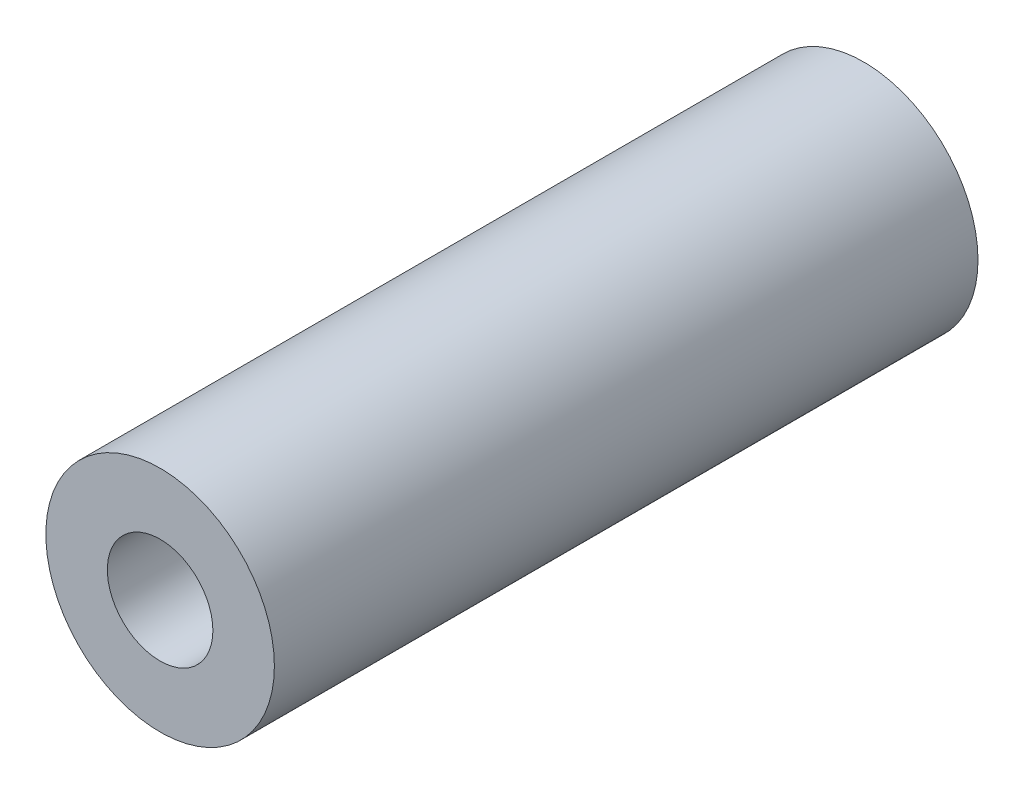
ISO-10303-21;
HEADER;
FILE_DESCRIPTION(('STEP AP214'),'2;1');
FILE_NAME('part.step','',(''),(''),'','','');
FILE_SCHEMA(('AUTOMOTIVE_DESIGN { 1 0 10303 214 1 1 1 1 }'));
ENDSEC;
DATA;
#1=APPLICATION_CONTEXT('core data for automotive mechanical design processes');
#2=APPLICATION_PROTOCOL_DEFINITION('international standard','automotive_design',2000,#1);
#3=PRODUCT_CONTEXT('',#1,'mechanical');
#4=PRODUCT('Part','Part','',(#3));
#5=PRODUCT_RELATED_PRODUCT_CATEGORY('part','',(#4));
#6=PRODUCT_DEFINITION_FORMATION('','',#4);
#7=PRODUCT_DEFINITION_CONTEXT('part definition',#1,'design');
#8=PRODUCT_DEFINITION('design','',#6,#7);
#9=PRODUCT_DEFINITION_SHAPE('','',#8);
#10=(LENGTH_UNIT() NAMED_UNIT(*) SI_UNIT(.MILLI.,.METRE.));
#11=(NAMED_UNIT(*) PLANE_ANGLE_UNIT() SI_UNIT($,.RADIAN.));
#12=(NAMED_UNIT(*) SI_UNIT($,.STERADIAN.) SOLID_ANGLE_UNIT());
#13=UNCERTAINTY_MEASURE_WITH_UNIT(LENGTH_MEASURE(1.E-05),#10,'distance_accuracy_value','');
#14=(GEOMETRIC_REPRESENTATION_CONTEXT(3) GLOBAL_UNCERTAINTY_ASSIGNED_CONTEXT((#13)) GLOBAL_UNIT_ASSIGNED_CONTEXT((#10,
#11,#12)) REPRESENTATION_CONTEXT('',''));
#15=CARTESIAN_POINT('',(0.,0.,0.));
#16=DIRECTION('',(0.,0.,1.));
#17=DIRECTION('',(1.,0.,0.));
#18=AXIS2_PLACEMENT_3D('',#15,#16,#17);
#19=CARTESIAN_POINT('',(0.,0.,63.5));
#20=DIRECTION('',(0.,0.,1.));
#21=DIRECTION('',(1.,0.,0.));
#22=AXIS2_PLACEMENT_3D('',#19,#20,#21);
#23=PLANE('',#22);
#24=CARTESIAN_POINT('',(0.,0.,63.5));
#25=DIRECTION('',(0.,0.,1.));
#26=DIRECTION('',(1.,0.,0.));
#27=AXIS2_PLACEMENT_3D('',#24,#25,#26);
#28=CIRCLE('',#27,10.3124);
#29=CARTESIAN_POINT('',(10.3124,0.,63.5));
#30=VERTEX_POINT('',#29);
#31=EDGE_CURVE('E10',#30,#30,#28,.T.);
#32=ORIENTED_EDGE('',*,*,#31,.T.);
#33=EDGE_LOOP('',(#32));
#34=FACE_BOUND('',#33,.T.);
#35=CARTESIAN_POINT('',(0.,0.,63.5));
#36=DIRECTION('',(0.,0.,1.));
#37=DIRECTION('',(1.,0.,0.));
#38=AXIS2_PLACEMENT_3D('',#35,#36,#37);
#39=CIRCLE('',#38,4.7625);
#40=CARTESIAN_POINT('',(4.7625,0.,63.5));
#41=VERTEX_POINT('',#40);
#42=EDGE_CURVE('E46',#41,#41,#39,.T.);
#43=ORIENTED_EDGE('',*,*,#42,.F.);
#44=EDGE_LOOP('',(#43));
#45=FACE_BOUND('',#44,.T.);
#46=ADVANCED_FACE('F35',(#34,#45),#23,.T.);
#47=CARTESIAN_POINT('',(0.,0.,0.));
#48=DIRECTION('',(0.,0.,1.));
#49=DIRECTION('',(1.,0.,0.));
#50=AXIS2_PLACEMENT_3D('',#47,#48,#49);
#51=PLANE('',#50);
#52=CARTESIAN_POINT('',(0.,0.,0.));
#53=DIRECTION('',(0.,0.,1.));
#54=DIRECTION('',(1.,0.,0.));
#55=AXIS2_PLACEMENT_3D('',#52,#53,#54);
#56=CIRCLE('',#55,10.3124);
#57=CARTESIAN_POINT('',(10.3124,0.,0.));
#58=VERTEX_POINT('',#57);
#59=EDGE_CURVE('E39',#58,#58,#56,.T.);
#60=ORIENTED_EDGE('',*,*,#59,.F.);
#61=EDGE_LOOP('',(#60));
#62=FACE_BOUND('',#61,.T.);
#63=CARTESIAN_POINT('',(0.,0.,0.));
#64=DIRECTION('',(0.,0.,1.));
#65=DIRECTION('',(1.,0.,0.));
#66=AXIS2_PLACEMENT_3D('',#63,#64,#65);
#67=CIRCLE('',#66,4.7625);
#68=CARTESIAN_POINT('',(4.7625,0.,0.));
#69=VERTEX_POINT('',#68);
#70=EDGE_CURVE('E48',#69,#69,#67,.T.);
#71=ORIENTED_EDGE('',*,*,#70,.T.);
#72=EDGE_LOOP('',(#71));
#73=FACE_BOUND('',#72,.T.);
#74=ADVANCED_FACE('F58',(#62,#73),#51,.F.);
#75=CARTESIAN_POINT('',(0.,0.,63.5));
#76=DIRECTION('',(0.,0.,-1.));
#77=DIRECTION('',(-1.,0.,0.));
#78=AXIS2_PLACEMENT_3D('',#75,#76,#77);
#79=CYLINDRICAL_SURFACE('',#78,10.3124);
#80=ORIENTED_EDGE('',*,*,#31,.F.);
#81=EDGE_LOOP('',(#80));
#82=FACE_BOUND('',#81,.T.);
#83=ORIENTED_EDGE('',*,*,#59,.T.);
#84=EDGE_LOOP('',(#83));
#85=FACE_BOUND('',#84,.T.);
#86=ADVANCED_FACE('F37',(#82,#85),#79,.T.);
#87=CARTESIAN_POINT('',(0.,0.,63.5));
#88=DIRECTION('',(0.,0.,-1.));
#89=DIRECTION('',(-1.,0.,0.));
#90=AXIS2_PLACEMENT_3D('',#87,#88,#89);
#91=CYLINDRICAL_SURFACE('',#90,4.7625);
#92=ORIENTED_EDGE('',*,*,#42,.T.);
#93=EDGE_LOOP('',(#92));
#94=FACE_BOUND('',#93,.T.);
#95=ORIENTED_EDGE('',*,*,#70,.F.);
#96=EDGE_LOOP('',(#95));
#97=FACE_BOUND('',#96,.T.);
#98=ADVANCED_FACE('F54',(#94,#97),#91,.F.);
#99=CLOSED_SHELL('',(#46,#74,#86,#98));
#100=MANIFOLD_SOLID_BREP('B2',#99);
#101=ADVANCED_BREP_SHAPE_REPRESENTATION('',(#18,#100),#14);
#102=SHAPE_DEFINITION_REPRESENTATION(#9,#101);
ENDSEC;
END-ISO-10303-21;
